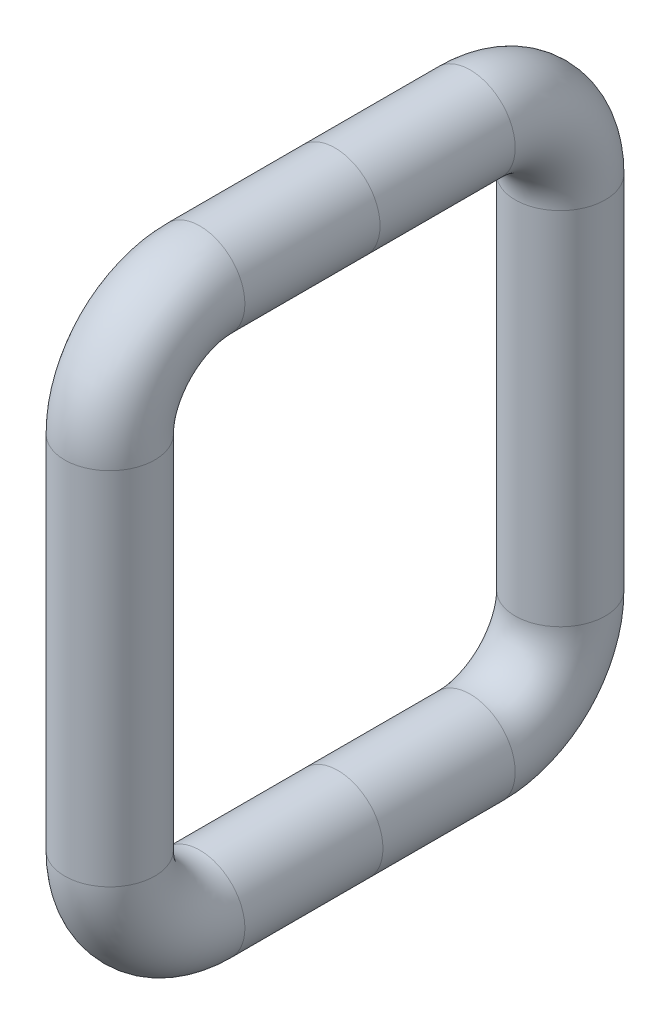
ISO-10303-21;
HEADER;
FILE_DESCRIPTION(('STEP AP214'),'2;1');
FILE_NAME('part.step','',(''),(''),'','','');
FILE_SCHEMA(('AUTOMOTIVE_DESIGN { 1 0 10303 214 1 1 1 1 }'));
ENDSEC;
DATA;
#1=APPLICATION_CONTEXT('core data for automotive mechanical design processes');
#2=APPLICATION_PROTOCOL_DEFINITION('international standard','automotive_design',2000,#1);
#3=PRODUCT_CONTEXT('',#1,'mechanical');
#4=PRODUCT('Part','Part','',(#3));
#5=PRODUCT_RELATED_PRODUCT_CATEGORY('part','',(#4));
#6=PRODUCT_DEFINITION_FORMATION('','',#4);
#7=PRODUCT_DEFINITION_CONTEXT('part definition',#1,'design');
#8=PRODUCT_DEFINITION('design','',#6,#7);
#9=PRODUCT_DEFINITION_SHAPE('','',#8);
#10=(LENGTH_UNIT() NAMED_UNIT(*) SI_UNIT(.MILLI.,.METRE.));
#11=(NAMED_UNIT(*) PLANE_ANGLE_UNIT() SI_UNIT($,.RADIAN.));
#12=(NAMED_UNIT(*) SI_UNIT($,.STERADIAN.) SOLID_ANGLE_UNIT());
#13=UNCERTAINTY_MEASURE_WITH_UNIT(LENGTH_MEASURE(1.E-05),#10,'distance_accuracy_value','');
#14=(GEOMETRIC_REPRESENTATION_CONTEXT(3) GLOBAL_UNCERTAINTY_ASSIGNED_CONTEXT((#13)) GLOBAL_UNIT_ASSIGNED_CONTEXT((#10,
#11,#12)) REPRESENTATION_CONTEXT('',''));
#15=CARTESIAN_POINT('',(0.,0.,0.));
#16=DIRECTION('',(0.,0.,1.));
#17=DIRECTION('',(1.,0.,0.));
#18=AXIS2_PLACEMENT_3D('',#15,#16,#17);
#19=CARTESIAN_POINT('',(0.,36.9685590921862,-76.2));
#20=DIRECTION('',(0.,0.,1.));
#21=DIRECTION('',(1.,0.,0.));
#22=AXIS2_PLACEMENT_3D('',#19,#20,#21);
#23=CYLINDRICAL_SURFACE('',#22,25.4);
#24=CARTESIAN_POINT('',(0.,36.9685590921862,0.));
#25=DIRECTION('',(0.,0.,1.));
#26=DIRECTION('',(1.,0.,0.));
#27=AXIS2_PLACEMENT_3D('',#24,#25,#26);
#28=CIRCLE('',#27,25.4);
#29=CARTESIAN_POINT('',(25.4,36.9685590921862,0.));
#30=VERTEX_POINT('',#29);
#31=EDGE_CURVE('E67',#30,#30,#28,.T.);
#32=ORIENTED_EDGE('',*,*,#31,.F.);
#33=EDGE_LOOP('',(#32));
#34=FACE_BOUND('',#33,.T.);
#35=CARTESIAN_POINT('',(0.,36.9685590921862,-76.2));
#36=DIRECTION('',(0.,0.,1.));
#37=DIRECTION('',(1.,0.,0.));
#38=AXIS2_PLACEMENT_3D('',#35,#36,#37);
#39=CIRCLE('',#38,25.4);
#40=CARTESIAN_POINT('',(0.,62.3685590921862,-76.2));
#41=VERTEX_POINT('',#40);
#42=EDGE_CURVE('E10',#41,#41,#39,.T.);
#43=ORIENTED_EDGE('',*,*,#42,.T.);
#44=EDGE_LOOP('',(#43));
#45=FACE_BOUND('',#44,.T.);
#46=ADVANCED_FACE('F33',(#34,#45),#23,.T.);
#47=CARTESIAN_POINT('',(0.,-13.8314409078138,-76.2));
#48=DIRECTION('',(1.,0.,0.));
#49=DIRECTION('',(0.,0.,-1.));
#50=AXIS2_PLACEMENT_3D('',#47,#48,#49);
#51=TOROIDAL_SURFACE('',#50,50.8,25.4);
#52=CARTESIAN_POINT('',(0.,-13.8314409078138,-127.));
#53=DIRECTION('',(0.,1.,0.));
#54=DIRECTION('',(1.,0.,0.));
#55=AXIS2_PLACEMENT_3D('',#52,#53,#54);
#56=CIRCLE('',#55,25.4);
#57=CARTESIAN_POINT('',(0.,-13.8314409078138,-152.4));
#58=VERTEX_POINT('',#57);
#59=EDGE_CURVE('E39',#58,#58,#56,.T.);
#60=CARTESIAN_POINT('',(0.,-13.8314409078138,-76.2));
#61=DIRECTION('',(1.,0.,0.));
#62=DIRECTION('',(0.,0.,-1.));
#63=AXIS2_PLACEMENT_3D('',#60,#61,#62);
#64=CIRCLE('',#63,76.2);
#65=EDGE_CURVE('',#58,#41,#64,.T.);
#66=ORIENTED_EDGE('',*,*,#59,.T.);
#67=ORIENTED_EDGE('',*,*,#42,.F.);
#68=ORIENTED_EDGE('',*,*,#65,.T.);
#69=ORIENTED_EDGE('',*,*,#65,.F.);
#70=EDGE_LOOP('',(#66,#68,#67,#69));
#71=FACE_BOUND('',#70,.T.);
#72=ADVANCED_FACE('F74',(#71),#51,.T.);
#73=CARTESIAN_POINT('',(0.,-217.031440907814,-127.));
#74=DIRECTION('',(0.,1.,0.));
#75=DIRECTION('',(0.,0.,1.));
#76=AXIS2_PLACEMENT_3D('',#73,#74,#75);
#77=CYLINDRICAL_SURFACE('',#76,25.4);
#78=ORIENTED_EDGE('',*,*,#59,.F.);
#79=EDGE_LOOP('',(#78));
#80=FACE_BOUND('',#79,.T.);
#81=CARTESIAN_POINT('',(0.,-217.031440907814,-127.));
#82=DIRECTION('',(0.,1.,0.));
#83=DIRECTION('',(1.,0.,0.));
#84=AXIS2_PLACEMENT_3D('',#81,#82,#83);
#85=CIRCLE('',#84,25.4);
#86=CARTESIAN_POINT('',(0.,-217.031440907814,-152.4));
#87=VERTEX_POINT('',#86);
#88=EDGE_CURVE('E43',#87,#87,#85,.T.);
#89=ORIENTED_EDGE('',*,*,#88,.T.);
#90=EDGE_LOOP('',(#89));
#91=FACE_BOUND('',#90,.T.);
#92=ADVANCED_FACE('F78',(#80,#91),#77,.T.);
#93=CARTESIAN_POINT('',(0.,-217.031440907814,-76.2));
#94=DIRECTION('',(1.,0.,0.));
#95=DIRECTION('',(0.,0.,-1.));
#96=AXIS2_PLACEMENT_3D('',#93,#94,#95);
#97=TOROIDAL_SURFACE('',#96,50.8,25.4);
#98=CARTESIAN_POINT('',(0.,-267.831440907814,-76.2));
#99=DIRECTION('',(0.,0.,-1.));
#100=DIRECTION('',(1.,0.,0.));
#101=AXIS2_PLACEMENT_3D('',#98,#99,#100);
#102=CIRCLE('',#101,25.4);
#103=CARTESIAN_POINT('',(0.,-293.231440907814,-76.2));
#104=VERTEX_POINT('',#103);
#105=EDGE_CURVE('E47',#104,#104,#102,.T.);
#106=CARTESIAN_POINT('',(0.,-217.031440907814,-76.2));
#107=DIRECTION('',(1.,0.,0.));
#108=DIRECTION('',(0.,0.,-1.));
#109=AXIS2_PLACEMENT_3D('',#106,#107,#108);
#110=CIRCLE('',#109,76.2);
#111=EDGE_CURVE('',#104,#87,#110,.T.);
#112=ORIENTED_EDGE('',*,*,#105,.T.);
#113=ORIENTED_EDGE('',*,*,#88,.F.);
#114=ORIENTED_EDGE('',*,*,#111,.T.);
#115=ORIENTED_EDGE('',*,*,#111,.F.);
#116=EDGE_LOOP('',(#112,#114,#113,#115));
#117=FACE_BOUND('',#116,.T.);
#118=ADVANCED_FACE('F83',(#117),#97,.T.);
#119=CARTESIAN_POINT('',(0.,-267.831440907814,-1.63913495022672));
#120=DIRECTION('',(0.,0.,-1.));
#121=DIRECTION('',(-1.,0.,0.));
#122=AXIS2_PLACEMENT_3D('',#119,#120,#121);
#123=CYLINDRICAL_SURFACE('',#122,25.4);
#124=ORIENTED_EDGE('',*,*,#105,.F.);
#125=EDGE_LOOP('',(#124));
#126=FACE_BOUND('',#125,.T.);
#127=CARTESIAN_POINT('',(0.,-267.831440907814,-1.63913495022672));
#128=DIRECTION('',(0.,0.,-1.));
#129=DIRECTION('',(1.,0.,0.));
#130=AXIS2_PLACEMENT_3D('',#127,#128,#129);
#131=CIRCLE('',#130,25.4);
#132=CARTESIAN_POINT('',(25.4,-267.831440907814,-1.63913495022672));
#133=VERTEX_POINT('',#132);
#134=EDGE_CURVE('E52',#133,#133,#131,.T.);
#135=ORIENTED_EDGE('',*,*,#134,.T.);
#136=EDGE_LOOP('',(#135));
#137=FACE_BOUND('',#136,.T.);
#138=ADVANCED_FACE('F89',(#126,#137),#123,.T.);
#139=CARTESIAN_POINT('',(0.,-267.831440907814,76.2));
#140=DIRECTION('',(0.,0.,-1.));
#141=DIRECTION('',(-1.,0.,0.));
#142=AXIS2_PLACEMENT_3D('',#139,#140,#141);
#143=CYLINDRICAL_SURFACE('',#142,25.4);
#144=ORIENTED_EDGE('',*,*,#134,.F.);
#145=EDGE_LOOP('',(#144));
#146=FACE_BOUND('',#145,.T.);
#147=CARTESIAN_POINT('',(0.,-267.831440907814,76.2));
#148=DIRECTION('',(0.,0.,-1.));
#149=DIRECTION('',(1.,0.,0.));
#150=AXIS2_PLACEMENT_3D('',#147,#148,#149);
#151=CIRCLE('',#150,25.4);
#152=CARTESIAN_POINT('',(0.,-293.231440907814,76.2));
#153=VERTEX_POINT('',#152);
#154=EDGE_CURVE('E55',#153,#153,#151,.T.);
#155=ORIENTED_EDGE('',*,*,#154,.T.);
#156=EDGE_LOOP('',(#155));
#157=FACE_BOUND('',#156,.T.);
#158=ADVANCED_FACE('F93',(#146,#157),#143,.T.);
#159=CARTESIAN_POINT('',(0.,-217.031440907814,76.2));
#160=DIRECTION('',(1.,0.,0.));
#161=DIRECTION('',(0.,0.,-1.));
#162=AXIS2_PLACEMENT_3D('',#159,#160,#161);
#163=TOROIDAL_SURFACE('',#162,50.8,25.4);
#164=CARTESIAN_POINT('',(0.,-217.031440907814,127.));
#165=DIRECTION('',(0.,-1.,0.));
#166=DIRECTION('',(1.,0.,0.));
#167=AXIS2_PLACEMENT_3D('',#164,#165,#166);
#168=CIRCLE('',#167,25.4);
#169=CARTESIAN_POINT('',(0.,-217.031440907814,152.4));
#170=VERTEX_POINT('',#169);
#171=EDGE_CURVE('E58',#170,#170,#168,.T.);
#172=CARTESIAN_POINT('',(0.,-217.031440907814,76.2));
#173=DIRECTION('',(1.,0.,0.));
#174=DIRECTION('',(0.,0.,-1.));
#175=AXIS2_PLACEMENT_3D('',#172,#173,#174);
#176=CIRCLE('',#175,76.2);
#177=EDGE_CURVE('',#170,#153,#176,.T.);
#178=ORIENTED_EDGE('',*,*,#171,.T.);
#179=ORIENTED_EDGE('',*,*,#154,.F.);
#180=ORIENTED_EDGE('',*,*,#177,.T.);
#181=ORIENTED_EDGE('',*,*,#177,.F.);
#182=EDGE_LOOP('',(#178,#180,#179,#181));
#183=FACE_BOUND('',#182,.T.);
#184=ADVANCED_FACE('F97',(#183),#163,.T.);
#185=CARTESIAN_POINT('',(0.,-13.8314409078138,127.));
#186=DIRECTION('',(0.,-1.,0.));
#187=DIRECTION('',(0.,0.,-1.));
#188=AXIS2_PLACEMENT_3D('',#185,#186,#187);
#189=CYLINDRICAL_SURFACE('',#188,25.4);
#190=ORIENTED_EDGE('',*,*,#171,.F.);
#191=EDGE_LOOP('',(#190));
#192=FACE_BOUND('',#191,.T.);
#193=CARTESIAN_POINT('',(0.,-13.8314409078138,127.));
#194=DIRECTION('',(0.,-1.,0.));
#195=DIRECTION('',(1.,0.,0.));
#196=AXIS2_PLACEMENT_3D('',#193,#194,#195);
#197=CIRCLE('',#196,25.4);
#198=CARTESIAN_POINT('',(0.,-13.8314409078138,152.4));
#199=VERTEX_POINT('',#198);
#200=EDGE_CURVE('E61',#199,#199,#197,.T.);
#201=ORIENTED_EDGE('',*,*,#200,.T.);
#202=EDGE_LOOP('',(#201));
#203=FACE_BOUND('',#202,.T.);
#204=ADVANCED_FACE('F101',(#192,#203),#189,.T.);
#205=CARTESIAN_POINT('',(0.,-13.8314409078138,76.2));
#206=DIRECTION('',(1.,0.,0.));
#207=DIRECTION('',(0.,0.,-1.));
#208=AXIS2_PLACEMENT_3D('',#205,#206,#207);
#209=TOROIDAL_SURFACE('',#208,50.8,25.4);
#210=CARTESIAN_POINT('',(0.,36.9685590921862,76.2));
#211=DIRECTION('',(0.,0.,1.));
#212=DIRECTION('',(1.,0.,0.));
#213=AXIS2_PLACEMENT_3D('',#210,#211,#212);
#214=CIRCLE('',#213,25.4);
#215=CARTESIAN_POINT('',(0.,62.3685590921862,76.2));
#216=VERTEX_POINT('',#215);
#217=EDGE_CURVE('E64',#216,#216,#214,.T.);
#218=CARTESIAN_POINT('',(0.,-13.8314409078138,76.2));
#219=DIRECTION('',(1.,0.,0.));
#220=DIRECTION('',(0.,0.,-1.));
#221=AXIS2_PLACEMENT_3D('',#218,#219,#220);
#222=CIRCLE('',#221,76.2);
#223=EDGE_CURVE('',#216,#199,#222,.T.);
#224=ORIENTED_EDGE('',*,*,#217,.T.);
#225=ORIENTED_EDGE('',*,*,#200,.F.);
#226=ORIENTED_EDGE('',*,*,#223,.T.);
#227=ORIENTED_EDGE('',*,*,#223,.F.);
#228=EDGE_LOOP('',(#224,#226,#225,#227));
#229=FACE_BOUND('',#228,.T.);
#230=ADVANCED_FACE('F105',(#229),#209,.T.);
#231=CARTESIAN_POINT('',(0.,36.9685590921862,0.));
#232=DIRECTION('',(0.,0.,1.));
#233=DIRECTION('',(0.,-1.,0.));
#234=AXIS2_PLACEMENT_3D('',#231,#232,#233);
#235=CYLINDRICAL_SURFACE('',#234,25.4);
#236=ORIENTED_EDGE('',*,*,#217,.F.);
#237=EDGE_LOOP('',(#236));
#238=FACE_BOUND('',#237,.T.);
#239=ORIENTED_EDGE('',*,*,#31,.T.);
#240=EDGE_LOOP('',(#239));
#241=FACE_BOUND('',#240,.T.);
#242=ADVANCED_FACE('F71',(#238,#241),#235,.T.);
#243=CLOSED_SHELL('',(#46,#72,#92,#118,#138,#158,#184,#204,#230,#242));
#244=MANIFOLD_SOLID_BREP('B2',#243);
#245=ADVANCED_BREP_SHAPE_REPRESENTATION('',(#18,#244),#14);
#246=SHAPE_DEFINITION_REPRESENTATION(#9,#245);
ENDSEC;
END-ISO-10303-21;
